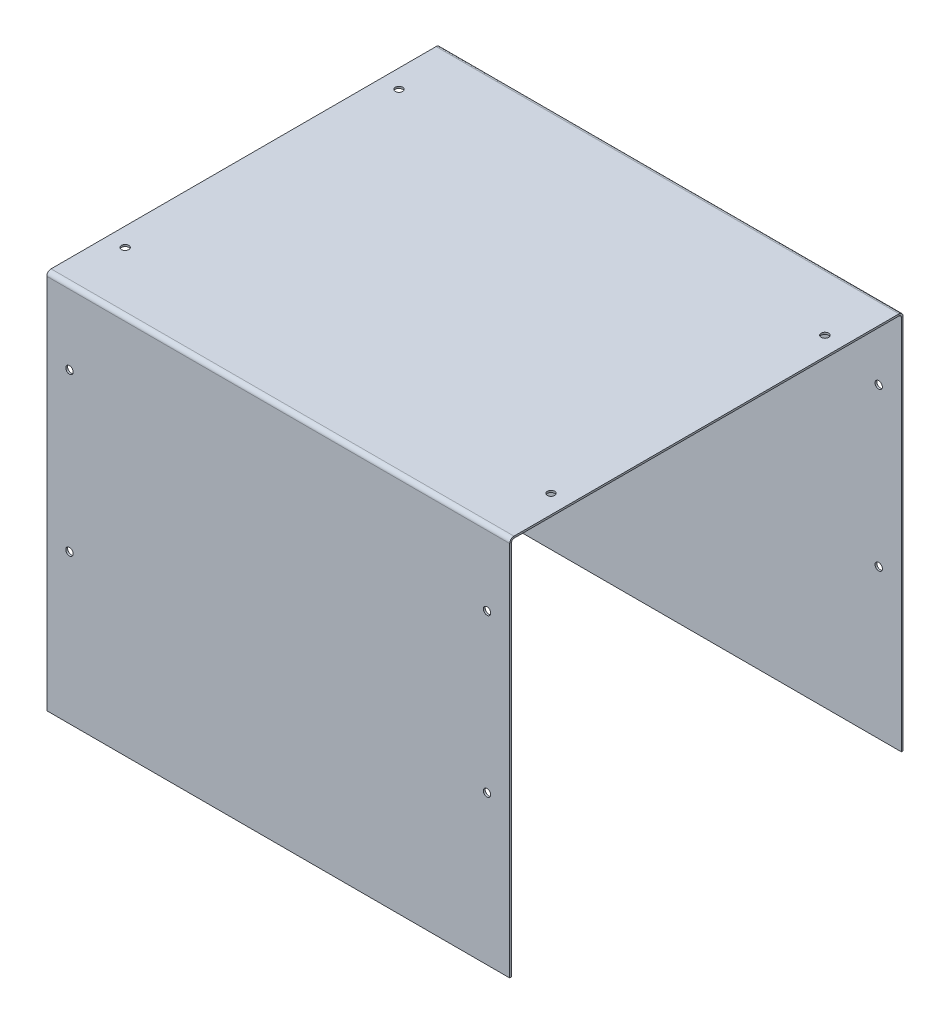
ISO-10303-21;
HEADER;
FILE_DESCRIPTION(('STEP AP214'),'2;1');
FILE_NAME('part.step','',(''),(''),'','','');
FILE_SCHEMA(('AUTOMOTIVE_DESIGN { 1 0 10303 214 1 1 1 1 }'));
ENDSEC;
DATA;
#1=APPLICATION_CONTEXT('core data for automotive mechanical design processes');
#2=APPLICATION_PROTOCOL_DEFINITION('international standard','automotive_design',2000,#1);
#3=PRODUCT_CONTEXT('',#1,'mechanical');
#4=PRODUCT('Part','Part','',(#3));
#5=PRODUCT_RELATED_PRODUCT_CATEGORY('part','',(#4));
#6=PRODUCT_DEFINITION_FORMATION('','',#4);
#7=PRODUCT_DEFINITION_CONTEXT('part definition',#1,'design');
#8=PRODUCT_DEFINITION('design','',#6,#7);
#9=PRODUCT_DEFINITION_SHAPE('','',#8);
#10=(LENGTH_UNIT() NAMED_UNIT(*) SI_UNIT(.MILLI.,.METRE.));
#11=(NAMED_UNIT(*) PLANE_ANGLE_UNIT() SI_UNIT($,.RADIAN.));
#12=(NAMED_UNIT(*) SI_UNIT($,.STERADIAN.) SOLID_ANGLE_UNIT());
#13=UNCERTAINTY_MEASURE_WITH_UNIT(LENGTH_MEASURE(1.E-05),#10,'distance_accuracy_value','');
#14=(GEOMETRIC_REPRESENTATION_CONTEXT(3) GLOBAL_UNCERTAINTY_ASSIGNED_CONTEXT((#13)) GLOBAL_UNIT_ASSIGNED_CONTEXT((#10,
#11,#12)) REPRESENTATION_CONTEXT('',''));
#15=CARTESIAN_POINT('',(0.,0.,0.));
#16=DIRECTION('',(0.,0.,1.));
#17=DIRECTION('',(1.,0.,0.));
#18=AXIS2_PLACEMENT_3D('',#15,#16,#17);
#19=CARTESIAN_POINT('',(250.,-411.,212.500000000001));
#20=DIRECTION('',(0.,1.,0.));
#21=DIRECTION('',(1.,0.,0.));
#22=AXIS2_PLACEMENT_3D('',#19,#20,#21);
#23=PLANE('',#22);
#24=DIRECTION('',(0.,0.,1.));
#25=VECTOR('',#24,1.);
#26=CARTESIAN_POINT('',(-250.,-411.,212.500000000001));
#27=LINE('',#26,#25);
#28=CARTESIAN_POINT('',(-250.,-411.,210.500000000001));
#29=VERTEX_POINT('',#28);
#30=CARTESIAN_POINT('',(-250.,-411.,212.500000000001));
#31=VERTEX_POINT('',#30);
#32=EDGE_CURVE('E11',#29,#31,#27,.T.);
#33=ORIENTED_EDGE('',*,*,#32,.F.);
#34=DIRECTION('',(1.,0.,0.));
#35=VECTOR('',#34,1.);
#36=CARTESIAN_POINT('',(0.,-411.,210.500000000001));
#37=LINE('',#36,#35);
#38=CARTESIAN_POINT('',(250.,-411.,210.500000000001));
#39=VERTEX_POINT('',#38);
#40=EDGE_CURVE('E137',#29,#39,#37,.T.);
#41=ORIENTED_EDGE('',*,*,#40,.T.);
#42=DIRECTION('',(0.,0.,1.));
#43=VECTOR('',#42,1.);
#44=CARTESIAN_POINT('',(250.,-411.,212.500000000001));
#45=LINE('',#44,#43);
#46=CARTESIAN_POINT('',(250.,-411.,212.500000000001));
#47=VERTEX_POINT('',#46);
#48=EDGE_CURVE('E51',#39,#47,#45,.T.);
#49=ORIENTED_EDGE('',*,*,#48,.T.);
#50=DIRECTION('',(1.,0.,0.));
#51=VECTOR('',#50,1.);
#52=CARTESIAN_POINT('',(250.,-411.,212.500000000001));
#53=LINE('',#52,#51);
#54=EDGE_CURVE('E258',#31,#47,#53,.T.);
#55=ORIENTED_EDGE('',*,*,#54,.F.);
#56=EDGE_LOOP('',(#33,#41,#49,#55));
#57=FACE_BOUND('',#56,.T.);
#58=ADVANCED_FACE('F41',(#57),#23,.F.);
#59=CARTESIAN_POINT('',(250.,-1.99999999999999,212.5));
#60=DIRECTION('',(-1.,0.,0.));
#61=DIRECTION('',(0.,1.,0.));
#62=AXIS2_PLACEMENT_3D('',#59,#60,#61);
#63=PLANE('',#62);
#64=ORIENTED_EDGE('',*,*,#48,.F.);
#65=DIRECTION('',(0.,1.,0.));
#66=VECTOR('',#65,1.);
#67=CARTESIAN_POINT('',(250.,7.28593997662503E-13,210.5));
#68=LINE('',#67,#66);
#69=CARTESIAN_POINT('',(250.,-4.59999999999997,210.5));
#70=VERTEX_POINT('',#69);
#71=EDGE_CURVE('E144',#39,#70,#68,.T.);
#72=ORIENTED_EDGE('',*,*,#71,.T.);
#73=DIRECTION('',(0.,0.,1.));
#74=VECTOR('',#73,1.);
#75=CARTESIAN_POINT('',(250.,-4.59999999999996,212.5));
#76=LINE('',#75,#74);
#77=CARTESIAN_POINT('',(250.,-4.59999999999996,212.5));
#78=VERTEX_POINT('',#77);
#79=EDGE_CURVE('E59',#70,#78,#76,.T.);
#80=ORIENTED_EDGE('',*,*,#79,.T.);
#81=DIRECTION('',(0.,1.,0.));
#82=VECTOR('',#81,1.);
#83=CARTESIAN_POINT('',(250.,-1.99999999999999,212.5));
#84=LINE('',#83,#82);
#85=EDGE_CURVE('E261',#47,#78,#84,.T.);
#86=ORIENTED_EDGE('',*,*,#85,.F.);
#87=EDGE_LOOP('',(#64,#72,#80,#86));
#88=FACE_BOUND('',#87,.T.);
#89=ADVANCED_FACE('F265',(#88),#63,.F.);
#90=CARTESIAN_POINT('',(250.,-4.59999999999998,207.9));
#91=DIRECTION('',(1.,0.,0.));
#92=DIRECTION('',(0.,0.,-1.));
#93=AXIS2_PLACEMENT_3D('',#90,#91,#92);
#94=PLANE('',#93);
#95=ORIENTED_EDGE('',*,*,#79,.F.);
#96=CARTESIAN_POINT('',(250.,-4.59999999999998,207.9));
#97=DIRECTION('',(-1.,0.,0.));
#98=DIRECTION('',(0.,0.,1.));
#99=AXIS2_PLACEMENT_3D('',#96,#97,#98);
#100=CIRCLE('',#99,2.59999999999999);
#101=CARTESIAN_POINT('',(250.,-2.,207.9));
#102=VERTEX_POINT('',#101);
#103=EDGE_CURVE('E130',#102,#70,#100,.F.);
#104=ORIENTED_EDGE('',*,*,#103,.F.);
#105=DIRECTION('',(0.,1.,0.));
#106=VECTOR('',#105,1.);
#107=CARTESIAN_POINT('',(250.,0.,207.9));
#108=LINE('',#107,#106);
#109=CARTESIAN_POINT('',(250.,0.,207.9));
#110=VERTEX_POINT('',#109);
#111=EDGE_CURVE('E253',#102,#110,#108,.T.);
#112=ORIENTED_EDGE('',*,*,#111,.T.);
#113=CARTESIAN_POINT('',(250.,-4.59999999999998,207.9));
#114=DIRECTION('',(-1.,0.,0.));
#115=DIRECTION('',(0.,0.,1.));
#116=AXIS2_PLACEMENT_3D('',#113,#114,#115);
#117=CIRCLE('',#116,4.59999999999999);
#118=EDGE_CURVE('E119',#110,#78,#117,.F.);
#119=ORIENTED_EDGE('',*,*,#118,.T.);
#120=EDGE_LOOP('',(#95,#104,#112,#119));
#121=FACE_BOUND('',#120,.T.);
#122=ADVANCED_FACE('F507',(#121),#94,.T.);
#123=CARTESIAN_POINT('',(250.,0.,210.5));
#124=DIRECTION('',(-1.,0.,0.));
#125=DIRECTION('',(0.,0.,-1.));
#126=AXIS2_PLACEMENT_3D('',#123,#124,#125);
#127=PLANE('',#126);
#128=ORIENTED_EDGE('',*,*,#111,.F.);
#129=DIRECTION('',(0.,0.,-1.));
#130=VECTOR('',#129,1.);
#131=CARTESIAN_POINT('',(250.,-2.,0.));
#132=LINE('',#131,#130);
#133=CARTESIAN_POINT('',(250.,-2.00000000000002,-207.9));
#134=VERTEX_POINT('',#133);
#135=EDGE_CURVE('E182',#102,#134,#132,.T.);
#136=ORIENTED_EDGE('',*,*,#135,.T.);
#137=DIRECTION('',(0.,1.,0.));
#138=VECTOR('',#137,1.);
#139=CARTESIAN_POINT('',(250.,0.,-207.9));
#140=LINE('',#139,#138);
#141=CARTESIAN_POINT('',(250.,0.,-207.9));
#142=VERTEX_POINT('',#141);
#143=EDGE_CURVE('E250',#134,#142,#140,.T.);
#144=ORIENTED_EDGE('',*,*,#143,.T.);
#145=DIRECTION('',(0.,0.,-1.));
#146=VECTOR('',#145,1.);
#147=CARTESIAN_POINT('',(250.,0.,210.5));
#148=LINE('',#147,#146);
#149=EDGE_CURVE('E343',#110,#142,#148,.T.);
#150=ORIENTED_EDGE('',*,*,#149,.F.);
#151=EDGE_LOOP('',(#128,#136,#144,#150));
#152=FACE_BOUND('',#151,.T.);
#153=ADVANCED_FACE('F341',(#152),#127,.F.);
#154=CARTESIAN_POINT('',(250.,-4.60000000000001,-207.9));
#155=DIRECTION('',(-1.,0.,0.));
#156=DIRECTION('',(0.,0.,1.));
#157=AXIS2_PLACEMENT_3D('',#154,#155,#156);
#158=PLANE('',#157);
#159=ORIENTED_EDGE('',*,*,#143,.F.);
#160=CARTESIAN_POINT('',(250.,-4.60000000000001,-207.9));
#161=DIRECTION('',(1.,0.,0.));
#162=DIRECTION('',(0.,0.,-1.));
#163=AXIS2_PLACEMENT_3D('',#160,#161,#162);
#164=CIRCLE('',#163,2.59999999999999);
#165=CARTESIAN_POINT('',(250.,-4.59999999999999,-210.5));
#166=VERTEX_POINT('',#165);
#167=EDGE_CURVE('E166',#166,#134,#164,.T.);
#168=ORIENTED_EDGE('',*,*,#167,.F.);
#169=DIRECTION('',(0.,0.,-1.));
#170=VECTOR('',#169,1.);
#171=CARTESIAN_POINT('',(250.,-4.59999999999998,-212.5));
#172=LINE('',#171,#170);
#173=CARTESIAN_POINT('',(250.,-4.59999999999998,-212.5));
#174=VERTEX_POINT('',#173);
#175=EDGE_CURVE('E247',#166,#174,#172,.T.);
#176=ORIENTED_EDGE('',*,*,#175,.T.);
#177=CARTESIAN_POINT('',(250.,-4.60000000000001,-207.9));
#178=DIRECTION('',(1.,0.,0.));
#179=DIRECTION('',(0.,0.,-1.));
#180=AXIS2_PLACEMENT_3D('',#177,#178,#179);
#181=CIRCLE('',#180,4.59999999999999);
#182=EDGE_CURVE('E336',#174,#142,#181,.T.);
#183=ORIENTED_EDGE('',*,*,#182,.T.);
#184=EDGE_LOOP('',(#159,#168,#176,#183));
#185=FACE_BOUND('',#184,.T.);
#186=ADVANCED_FACE('F331',(#185),#158,.F.);
#187=CARTESIAN_POINT('',(250.,-411.,-212.500000000001));
#188=DIRECTION('',(-1.,0.,0.));
#189=DIRECTION('',(0.,-1.,0.));
#190=AXIS2_PLACEMENT_3D('',#187,#188,#189);
#191=PLANE('',#190);
#192=ORIENTED_EDGE('',*,*,#175,.F.);
#193=DIRECTION('',(0.,-1.,0.));
#194=VECTOR('',#193,1.);
#195=CARTESIAN_POINT('',(250.,7.28593997662503E-13,-210.5));
#196=LINE('',#195,#194);
#197=CARTESIAN_POINT('',(250.,-411.,-210.500000000001));
#198=VERTEX_POINT('',#197);
#199=EDGE_CURVE('E175',#166,#198,#196,.T.);
#200=ORIENTED_EDGE('',*,*,#199,.T.);
#201=DIRECTION('',(0.,0.,-1.));
#202=VECTOR('',#201,1.);
#203=CARTESIAN_POINT('',(250.,-411.,-212.500000000001));
#204=LINE('',#203,#202);
#205=CARTESIAN_POINT('',(250.,-411.,-212.500000000001));
#206=VERTEX_POINT('',#205);
#207=EDGE_CURVE('E244',#198,#206,#204,.T.);
#208=ORIENTED_EDGE('',*,*,#207,.T.);
#209=DIRECTION('',(0.,-1.,0.));
#210=VECTOR('',#209,1.);
#211=CARTESIAN_POINT('',(250.,-411.,-212.500000000001));
#212=LINE('',#211,#210);
#213=EDGE_CURVE('E381',#174,#206,#212,.T.);
#214=ORIENTED_EDGE('',*,*,#213,.F.);
#215=EDGE_LOOP('',(#192,#200,#208,#214));
#216=FACE_BOUND('',#215,.T.);
#217=ADVANCED_FACE('F570',(#216),#191,.F.);
#218=CARTESIAN_POINT('',(-250.,-411.,-212.500000000001));
#219=DIRECTION('',(0.,1.,0.));
#220=DIRECTION('',(-1.,0.,0.));
#221=AXIS2_PLACEMENT_3D('',#218,#219,#220);
#222=PLANE('',#221);
#223=ORIENTED_EDGE('',*,*,#207,.F.);
#224=DIRECTION('',(1.,0.,0.));
#225=VECTOR('',#224,1.);
#226=CARTESIAN_POINT('',(0.,-411.,-210.500000000001));
#227=LINE('',#226,#225);
#228=CARTESIAN_POINT('',(-250.,-411.,-210.500000000001));
#229=VERTEX_POINT('',#228);
#230=EDGE_CURVE('E171',#198,#229,#227,.F.);
#231=ORIENTED_EDGE('',*,*,#230,.T.);
#232=DIRECTION('',(0.,0.,-1.));
#233=VECTOR('',#232,1.);
#234=CARTESIAN_POINT('',(-250.,-411.,-212.500000000001));
#235=LINE('',#234,#233);
#236=CARTESIAN_POINT('',(-250.,-411.,-212.500000000001));
#237=VERTEX_POINT('',#236);
#238=EDGE_CURVE('E241',#229,#237,#235,.T.);
#239=ORIENTED_EDGE('',*,*,#238,.T.);
#240=DIRECTION('',(-1.,0.,0.));
#241=VECTOR('',#240,1.);
#242=CARTESIAN_POINT('',(-250.,-411.,-212.500000000001));
#243=LINE('',#242,#241);
#244=EDGE_CURVE('E385',#206,#237,#243,.T.);
#245=ORIENTED_EDGE('',*,*,#244,.F.);
#246=EDGE_LOOP('',(#223,#231,#239,#245));
#247=FACE_BOUND('',#246,.T.);
#248=ADVANCED_FACE('F572',(#247),#222,.F.);
#249=CARTESIAN_POINT('',(-250.,-1.99999999999999,-212.5));
#250=DIRECTION('',(1.,0.,0.));
#251=DIRECTION('',(0.,1.,0.));
#252=AXIS2_PLACEMENT_3D('',#249,#250,#251);
#253=PLANE('',#252);
#254=ORIENTED_EDGE('',*,*,#238,.F.);
#255=DIRECTION('',(0.,-1.,0.));
#256=VECTOR('',#255,1.);
#257=CARTESIAN_POINT('',(-250.,7.28593997662503E-13,-210.5));
#258=LINE('',#257,#256);
#259=CARTESIAN_POINT('',(-250.,-4.6,-210.5));
#260=VERTEX_POINT('',#259);
#261=EDGE_CURVE('E167',#229,#260,#258,.F.);
#262=ORIENTED_EDGE('',*,*,#261,.T.);
#263=DIRECTION('',(0.,0.,-1.));
#264=VECTOR('',#263,1.);
#265=CARTESIAN_POINT('',(-250.,-4.6,-212.5));
#266=LINE('',#265,#264);
#267=CARTESIAN_POINT('',(-250.,-4.6,-212.5));
#268=VERTEX_POINT('',#267);
#269=EDGE_CURVE('E238',#260,#268,#266,.T.);
#270=ORIENTED_EDGE('',*,*,#269,.T.);
#271=DIRECTION('',(0.,1.,0.));
#272=VECTOR('',#271,1.);
#273=CARTESIAN_POINT('',(-250.,-1.99999999999999,-212.5));
#274=LINE('',#273,#272);
#275=EDGE_CURVE('E389',#237,#268,#274,.T.);
#276=ORIENTED_EDGE('',*,*,#275,.F.);
#277=EDGE_LOOP('',(#254,#262,#270,#276));
#278=FACE_BOUND('',#277,.T.);
#279=ADVANCED_FACE('F573',(#278),#253,.F.);
#280=CARTESIAN_POINT('',(-250.,-4.60000000000001,-207.9));
#281=DIRECTION('',(-1.,0.,0.));
#282=DIRECTION('',(0.,0.,1.));
#283=AXIS2_PLACEMENT_3D('',#280,#281,#282);
#284=PLANE('',#283);
#285=ORIENTED_EDGE('',*,*,#269,.F.);
#286=CARTESIAN_POINT('',(-250.,-4.60000000000001,-207.9));
#287=DIRECTION('',(1.,0.,0.));
#288=DIRECTION('',(0.,0.,-1.));
#289=AXIS2_PLACEMENT_3D('',#286,#287,#288);
#290=CIRCLE('',#289,2.59999999999999);
#291=CARTESIAN_POINT('',(-250.,-2.,-207.9));
#292=VERTEX_POINT('',#291);
#293=EDGE_CURVE('E161',#292,#260,#290,.F.);
#294=ORIENTED_EDGE('',*,*,#293,.F.);
#295=DIRECTION('',(0.,1.,0.));
#296=VECTOR('',#295,1.);
#297=CARTESIAN_POINT('',(-250.,0.,-207.9));
#298=LINE('',#297,#296);
#299=CARTESIAN_POINT('',(-250.,0.,-207.9));
#300=VERTEX_POINT('',#299);
#301=EDGE_CURVE('E235',#292,#300,#298,.T.);
#302=ORIENTED_EDGE('',*,*,#301,.T.);
#303=CARTESIAN_POINT('',(-250.,-4.60000000000001,-207.9));
#304=DIRECTION('',(1.,0.,0.));
#305=DIRECTION('',(0.,0.,-1.));
#306=AXIS2_PLACEMENT_3D('',#303,#304,#305);
#307=CIRCLE('',#306,4.59999999999999);
#308=EDGE_CURVE('E297',#300,#268,#307,.F.);
#309=ORIENTED_EDGE('',*,*,#308,.T.);
#310=EDGE_LOOP('',(#285,#294,#302,#309));
#311=FACE_BOUND('',#310,.T.);
#312=ADVANCED_FACE('F292',(#311),#284,.T.);
#313=CARTESIAN_POINT('',(-250.,0.,210.5));
#314=DIRECTION('',(1.,0.,0.));
#315=DIRECTION('',(0.,0.,1.));
#316=AXIS2_PLACEMENT_3D('',#313,#314,#315);
#317=PLANE('',#316);
#318=ORIENTED_EDGE('',*,*,#301,.F.);
#319=DIRECTION('',(0.,0.,-1.));
#320=VECTOR('',#319,1.);
#321=CARTESIAN_POINT('',(-250.,-2.,0.));
#322=LINE('',#321,#320);
#323=CARTESIAN_POINT('',(-250.,-2.,207.9));
#324=VERTEX_POINT('',#323);
#325=EDGE_CURVE('E156',#292,#324,#322,.F.);
#326=ORIENTED_EDGE('',*,*,#325,.T.);
#327=DIRECTION('',(0.,1.,0.));
#328=VECTOR('',#327,1.);
#329=CARTESIAN_POINT('',(-250.,0.,207.9));
#330=LINE('',#329,#328);
#331=CARTESIAN_POINT('',(-250.,0.,207.9));
#332=VERTEX_POINT('',#331);
#333=EDGE_CURVE('E118',#324,#332,#330,.T.);
#334=ORIENTED_EDGE('',*,*,#333,.T.);
#335=DIRECTION('',(0.,0.,1.));
#336=VECTOR('',#335,1.);
#337=CARTESIAN_POINT('',(-250.,0.,210.5));
#338=LINE('',#337,#336);
#339=EDGE_CURVE('E363',#300,#332,#338,.T.);
#340=ORIENTED_EDGE('',*,*,#339,.F.);
#341=EDGE_LOOP('',(#318,#326,#334,#340));
#342=FACE_BOUND('',#341,.T.);
#343=ADVANCED_FACE('F447',(#342),#317,.F.);
#344=CARTESIAN_POINT('',(-250.,-4.59999999999998,207.9));
#345=DIRECTION('',(1.,0.,0.));
#346=DIRECTION('',(0.,0.,-1.));
#347=AXIS2_PLACEMENT_3D('',#344,#345,#346);
#348=PLANE('',#347);
#349=ORIENTED_EDGE('',*,*,#333,.F.);
#350=CARTESIAN_POINT('',(-250.,-4.59999999999998,207.9));
#351=DIRECTION('',(-1.,0.,0.));
#352=DIRECTION('',(0.,0.,1.));
#353=AXIS2_PLACEMENT_3D('',#350,#351,#352);
#354=CIRCLE('',#353,2.59999999999999);
#355=CARTESIAN_POINT('',(-250.,-4.59999999999997,210.5));
#356=VERTEX_POINT('',#355);
#357=EDGE_CURVE('E127',#356,#324,#354,.T.);
#358=ORIENTED_EDGE('',*,*,#357,.F.);
#359=DIRECTION('',(0.,0.,1.));
#360=VECTOR('',#359,1.);
#361=CARTESIAN_POINT('',(-250.,-4.59999999999997,212.5));
#362=LINE('',#361,#360);
#363=CARTESIAN_POINT('',(-250.,-4.59999999999997,212.5));
#364=VERTEX_POINT('',#363);
#365=EDGE_CURVE('E45',#356,#364,#362,.T.);
#366=ORIENTED_EDGE('',*,*,#365,.T.);
#367=CARTESIAN_POINT('',(-250.,-4.59999999999998,207.9));
#368=DIRECTION('',(-1.,0.,0.));
#369=DIRECTION('',(0.,0.,1.));
#370=AXIS2_PLACEMENT_3D('',#367,#368,#369);
#371=CIRCLE('',#370,4.59999999999999);
#372=EDGE_CURVE('E267',#364,#332,#371,.T.);
#373=ORIENTED_EDGE('',*,*,#372,.T.);
#374=EDGE_LOOP('',(#349,#358,#366,#373));
#375=FACE_BOUND('',#374,.T.);
#376=ADVANCED_FACE('F140',(#375),#348,.F.);
#377=CARTESIAN_POINT('',(-230.,0.,147.9));
#378=DIRECTION('',(0.,-1.,0.));
#379=DIRECTION('',(0.,0.,-1.));
#380=AXIS2_PLACEMENT_3D('',#377,#378,#379);
#381=CYLINDRICAL_SURFACE('',#380,3.99999999999999);
#382=CARTESIAN_POINT('',(-230.,0.,147.9));
#383=DIRECTION('',(0.,1.,0.));
#384=DIRECTION('',(0.,0.,-1.));
#385=AXIS2_PLACEMENT_3D('',#382,#383,#384);
#386=CIRCLE('',#385,3.99999999999999);
#387=CARTESIAN_POINT('',(-230.,0.,143.9));
#388=VERTEX_POINT('',#387);
#389=EDGE_CURVE('E149',#388,#388,#386,.T.);
#390=ORIENTED_EDGE('',*,*,#389,.T.);
#391=EDGE_LOOP('',(#390));
#392=FACE_BOUND('',#391,.T.);
#393=CARTESIAN_POINT('',(-230.,-2.,147.9));
#394=DIRECTION('',(0.,1.,0.));
#395=DIRECTION('',(0.,0.,1.));
#396=AXIS2_PLACEMENT_3D('',#393,#394,#395);
#397=CIRCLE('',#396,3.99999999999999);
#398=CARTESIAN_POINT('',(-230.,-2.,151.9));
#399=VERTEX_POINT('',#398);
#400=EDGE_CURVE('E203',#399,#399,#397,.T.);
#401=ORIENTED_EDGE('',*,*,#400,.F.);
#402=EDGE_LOOP('',(#401));
#403=FACE_BOUND('',#402,.T.);
#404=ADVANCED_FACE('F470',(#392,#403),#381,.F.);
#405=CARTESIAN_POINT('',(230.,0.,147.9));
#406=DIRECTION('',(0.,-1.,0.));
#407=DIRECTION('',(0.,0.,-1.));
#408=AXIS2_PLACEMENT_3D('',#405,#406,#407);
#409=CYLINDRICAL_SURFACE('',#408,3.99999999999999);
#410=CARTESIAN_POINT('',(230.,0.,147.9));
#411=DIRECTION('',(0.,-1.,0.));
#412=DIRECTION('',(0.,0.,-1.));
#413=AXIS2_PLACEMENT_3D('',#410,#411,#412);
#414=CIRCLE('',#413,3.99999999999999);
#415=CARTESIAN_POINT('',(230.,0.,143.9));
#416=VERTEX_POINT('',#415);
#417=EDGE_CURVE('E461',#416,#416,#414,.T.);
#418=ORIENTED_EDGE('',*,*,#417,.F.);
#419=EDGE_LOOP('',(#418));
#420=FACE_BOUND('',#419,.T.);
#421=CARTESIAN_POINT('',(230.,-2.,147.9));
#422=DIRECTION('',(0.,-1.,0.));
#423=DIRECTION('',(0.,0.,-1.));
#424=AXIS2_PLACEMENT_3D('',#421,#422,#423);
#425=CIRCLE('',#424,3.99999999999999);
#426=CARTESIAN_POINT('',(230.,-2.,143.9));
#427=VERTEX_POINT('',#426);
#428=EDGE_CURVE('E207',#427,#427,#425,.T.);
#429=ORIENTED_EDGE('',*,*,#428,.T.);
#430=EDGE_LOOP('',(#429));
#431=FACE_BOUND('',#430,.T.);
#432=ADVANCED_FACE('F531',(#420,#431),#409,.F.);
#433=CARTESIAN_POINT('',(-230.,0.,-147.9));
#434=DIRECTION('',(0.,-1.,0.));
#435=DIRECTION('',(0.,0.,-1.));
#436=AXIS2_PLACEMENT_3D('',#433,#434,#435);
#437=CYLINDRICAL_SURFACE('',#436,3.99999999999999);
#438=CARTESIAN_POINT('',(-230.,0.,-147.9));
#439=DIRECTION('',(0.,-1.,0.));
#440=DIRECTION('',(0.,0.,1.));
#441=AXIS2_PLACEMENT_3D('',#438,#439,#440);
#442=CIRCLE('',#441,3.99999999999999);
#443=CARTESIAN_POINT('',(-230.,0.,-143.9));
#444=VERTEX_POINT('',#443);
#445=EDGE_CURVE('E457',#444,#444,#442,.T.);
#446=ORIENTED_EDGE('',*,*,#445,.F.);
#447=EDGE_LOOP('',(#446));
#448=FACE_BOUND('',#447,.T.);
#449=CARTESIAN_POINT('',(-230.,-2.,-147.9));
#450=DIRECTION('',(0.,-1.,0.));
#451=DIRECTION('',(0.,0.,-1.));
#452=AXIS2_PLACEMENT_3D('',#449,#450,#451);
#453=CIRCLE('',#452,3.99999999999999);
#454=CARTESIAN_POINT('',(-230.,-2.,-151.9));
#455=VERTEX_POINT('',#454);
#456=EDGE_CURVE('E211',#455,#455,#453,.T.);
#457=ORIENTED_EDGE('',*,*,#456,.T.);
#458=EDGE_LOOP('',(#457));
#459=FACE_BOUND('',#458,.T.);
#460=ADVANCED_FACE('F487',(#448,#459),#437,.F.);
#461=CARTESIAN_POINT('',(230.,0.,-147.9));
#462=DIRECTION('',(0.,-1.,0.));
#463=DIRECTION('',(0.,0.,-1.));
#464=AXIS2_PLACEMENT_3D('',#461,#462,#463);
#465=CYLINDRICAL_SURFACE('',#464,3.99999999999999);
#466=CARTESIAN_POINT('',(230.,0.,-147.9));
#467=DIRECTION('',(0.,1.,0.));
#468=DIRECTION('',(0.,0.,1.));
#469=AXIS2_PLACEMENT_3D('',#466,#467,#468);
#470=CIRCLE('',#469,3.99999999999999);
#471=CARTESIAN_POINT('',(230.,0.,-143.9));
#472=VERTEX_POINT('',#471);
#473=EDGE_CURVE('E451',#472,#472,#470,.T.);
#474=ORIENTED_EDGE('',*,*,#473,.T.);
#475=EDGE_LOOP('',(#474));
#476=FACE_BOUND('',#475,.T.);
#477=CARTESIAN_POINT('',(230.,-2.,-147.9));
#478=DIRECTION('',(0.,1.,0.));
#479=DIRECTION('',(0.,0.,1.));
#480=AXIS2_PLACEMENT_3D('',#477,#478,#479);
#481=CIRCLE('',#480,3.99999999999999);
#482=CARTESIAN_POINT('',(230.,-2.,-143.9));
#483=VERTEX_POINT('',#482);
#484=EDGE_CURVE('E215',#483,#483,#481,.T.);
#485=ORIENTED_EDGE('',*,*,#484,.F.);
#486=EDGE_LOOP('',(#485));
#487=FACE_BOUND('',#486,.T.);
#488=ADVANCED_FACE('F483',(#476,#487),#465,.F.);
#489=CARTESIAN_POINT('',(-225.5,-80.,-212.500000000001));
#490=DIRECTION('',(0.,0.,1.));
#491=DIRECTION('',(0.,-1.,0.));
#492=AXIS2_PLACEMENT_3D('',#489,#490,#491);
#493=CYLINDRICAL_SURFACE('',#492,3.99999999999999);
#494=CARTESIAN_POINT('',(-225.5,-80.,-212.500000000001));
#495=DIRECTION('',(0.,0.,-1.));
#496=DIRECTION('',(-1.,0.,0.));
#497=AXIS2_PLACEMENT_3D('',#494,#495,#496);
#498=CIRCLE('',#497,3.99999999999999);
#499=CARTESIAN_POINT('',(-229.5,-80.,-212.500000000001));
#500=VERTEX_POINT('',#499);
#501=EDGE_CURVE('E355',#500,#500,#498,.T.);
#502=ORIENTED_EDGE('',*,*,#501,.T.);
#503=EDGE_LOOP('',(#502));
#504=FACE_BOUND('',#503,.T.);
#505=CARTESIAN_POINT('',(-225.5,-80.,-210.500000000001));
#506=DIRECTION('',(0.,0.,-1.));
#507=DIRECTION('',(-1.,0.,0.));
#508=AXIS2_PLACEMENT_3D('',#505,#506,#507);
#509=CIRCLE('',#508,3.99999999999999);
#510=CARTESIAN_POINT('',(-229.5,-80.,-210.500000000001));
#511=VERTEX_POINT('',#510);
#512=EDGE_CURVE('E185',#511,#511,#509,.T.);
#513=ORIENTED_EDGE('',*,*,#512,.F.);
#514=EDGE_LOOP('',(#513));
#515=FACE_BOUND('',#514,.T.);
#516=ADVANCED_FACE('F486',(#504,#515),#493,.F.);
#517=CARTESIAN_POINT('',(-225.5,-250.,-212.500000000001));
#518=DIRECTION('',(0.,0.,1.));
#519=DIRECTION('',(0.,-1.,0.));
#520=AXIS2_PLACEMENT_3D('',#517,#518,#519);
#521=CYLINDRICAL_SURFACE('',#520,3.99999999999999);
#522=CARTESIAN_POINT('',(-225.5,-250.,-212.500000000001));
#523=DIRECTION('',(0.,0.,-1.));
#524=DIRECTION('',(-1.,0.,0.));
#525=AXIS2_PLACEMENT_3D('',#522,#523,#524);
#526=CIRCLE('',#525,3.99999999999999);
#527=CARTESIAN_POINT('',(-229.5,-250.,-212.500000000001));
#528=VERTEX_POINT('',#527);
#529=EDGE_CURVE('E361',#528,#528,#526,.T.);
#530=ORIENTED_EDGE('',*,*,#529,.T.);
#531=EDGE_LOOP('',(#530));
#532=FACE_BOUND('',#531,.T.);
#533=CARTESIAN_POINT('',(-225.5,-250.,-210.500000000001));
#534=DIRECTION('',(0.,0.,-1.));
#535=DIRECTION('',(-1.,0.,0.));
#536=AXIS2_PLACEMENT_3D('',#533,#534,#535);
#537=CIRCLE('',#536,3.99999999999999);
#538=CARTESIAN_POINT('',(-229.5,-250.,-210.500000000001));
#539=VERTEX_POINT('',#538);
#540=EDGE_CURVE('E222',#539,#539,#537,.T.);
#541=ORIENTED_EDGE('',*,*,#540,.F.);
#542=EDGE_LOOP('',(#541));
#543=FACE_BOUND('',#542,.T.);
#544=ADVANCED_FACE('F540',(#532,#543),#521,.F.);
#545=CARTESIAN_POINT('',(225.5,-80.,-212.500000000001));
#546=DIRECTION('',(0.,0.,1.));
#547=DIRECTION('',(0.,-1.,0.));
#548=AXIS2_PLACEMENT_3D('',#545,#546,#547);
#549=CYLINDRICAL_SURFACE('',#548,3.99999999999999);
#550=CARTESIAN_POINT('',(225.5,-80.,-212.500000000001));
#551=DIRECTION('',(0.,0.,1.));
#552=DIRECTION('',(1.,0.,0.));
#553=AXIS2_PLACEMENT_3D('',#550,#551,#552);
#554=CIRCLE('',#553,3.99999999999999);
#555=CARTESIAN_POINT('',(229.5,-80.,-212.500000000001));
#556=VERTEX_POINT('',#555);
#557=EDGE_CURVE('E370',#556,#556,#554,.T.);
#558=ORIENTED_EDGE('',*,*,#557,.F.);
#559=EDGE_LOOP('',(#558));
#560=FACE_BOUND('',#559,.T.);
#561=CARTESIAN_POINT('',(225.5,-80.,-210.500000000001));
#562=DIRECTION('',(0.,0.,1.));
#563=DIRECTION('',(1.,0.,0.));
#564=AXIS2_PLACEMENT_3D('',#561,#562,#563);
#565=CIRCLE('',#564,3.99999999999999);
#566=CARTESIAN_POINT('',(229.5,-80.,-210.500000000001));
#567=VERTEX_POINT('',#566);
#568=EDGE_CURVE('E226',#567,#567,#565,.T.);
#569=ORIENTED_EDGE('',*,*,#568,.T.);
#570=EDGE_LOOP('',(#569));
#571=FACE_BOUND('',#570,.T.);
#572=ADVANCED_FACE('F543',(#560,#571),#549,.F.);
#573=CARTESIAN_POINT('',(225.5,-250.,-212.500000000001));
#574=DIRECTION('',(0.,0.,1.));
#575=DIRECTION('',(0.,-1.,0.));
#576=AXIS2_PLACEMENT_3D('',#573,#574,#575);
#577=CYLINDRICAL_SURFACE('',#576,3.99999999999999);
#578=CARTESIAN_POINT('',(225.5,-250.,-212.500000000001));
#579=DIRECTION('',(0.,0.,1.));
#580=DIRECTION('',(1.,0.,0.));
#581=AXIS2_PLACEMENT_3D('',#578,#579,#580);
#582=CIRCLE('',#581,3.99999999999999);
#583=CARTESIAN_POINT('',(229.5,-250.,-212.500000000001));
#584=VERTEX_POINT('',#583);
#585=EDGE_CURVE('E374',#584,#584,#582,.T.);
#586=ORIENTED_EDGE('',*,*,#585,.F.);
#587=EDGE_LOOP('',(#586));
#588=FACE_BOUND('',#587,.T.);
#589=CARTESIAN_POINT('',(225.5,-250.,-210.500000000001));
#590=DIRECTION('',(0.,0.,1.));
#591=DIRECTION('',(1.,0.,0.));
#592=AXIS2_PLACEMENT_3D('',#589,#590,#591);
#593=CIRCLE('',#592,3.99999999999999);
#594=CARTESIAN_POINT('',(229.5,-250.,-210.500000000001));
#595=VERTEX_POINT('',#594);
#596=EDGE_CURVE('E230',#595,#595,#593,.T.);
#597=ORIENTED_EDGE('',*,*,#596,.T.);
#598=EDGE_LOOP('',(#597));
#599=FACE_BOUND('',#598,.T.);
#600=ADVANCED_FACE('F43',(#588,#599),#577,.F.);
#601=CARTESIAN_POINT('',(-225.5,-80.,212.500000000001));
#602=DIRECTION('',(0.,0.,-1.));
#603=DIRECTION('',(0.,1.,0.));
#604=AXIS2_PLACEMENT_3D('',#601,#602,#603);
#605=CYLINDRICAL_SURFACE('',#604,3.99999999999999);
#606=CARTESIAN_POINT('',(-225.5,-80.,212.500000000001));
#607=DIRECTION('',(0.,0.,-1.));
#608=DIRECTION('',(-1.,0.,0.));
#609=AXIS2_PLACEMENT_3D('',#606,#607,#608);
#610=CIRCLE('',#609,3.99999999999999);
#611=CARTESIAN_POINT('',(-229.5,-80.,212.500000000001));
#612=VERTEX_POINT('',#611);
#613=EDGE_CURVE('E396',#612,#612,#610,.T.);
#614=ORIENTED_EDGE('',*,*,#613,.F.);
#615=EDGE_LOOP('',(#614));
#616=FACE_BOUND('',#615,.T.);
#617=CARTESIAN_POINT('',(-225.5,-80.,210.500000000001));
#618=DIRECTION('',(0.,0.,-1.));
#619=DIRECTION('',(-1.,0.,0.));
#620=AXIS2_PLACEMENT_3D('',#617,#618,#619);
#621=CIRCLE('',#620,3.99999999999999);
#622=CARTESIAN_POINT('',(-229.5,-80.,210.500000000001));
#623=VERTEX_POINT('',#622);
#624=EDGE_CURVE('E165',#623,#623,#621,.T.);
#625=ORIENTED_EDGE('',*,*,#624,.T.);
#626=EDGE_LOOP('',(#625));
#627=FACE_BOUND('',#626,.T.);
#628=ADVANCED_FACE('F514',(#616,#627),#605,.F.);
#629=CARTESIAN_POINT('',(-225.5,-250.,212.500000000001));
#630=DIRECTION('',(0.,0.,-1.));
#631=DIRECTION('',(0.,1.,0.));
#632=AXIS2_PLACEMENT_3D('',#629,#630,#631);
#633=CYLINDRICAL_SURFACE('',#632,3.99999999999999);
#634=CARTESIAN_POINT('',(-225.5,-250.,212.500000000001));
#635=DIRECTION('',(0.,0.,-1.));
#636=DIRECTION('',(-1.,0.,0.));
#637=AXIS2_PLACEMENT_3D('',#634,#635,#636);
#638=CIRCLE('',#637,3.99999999999999);
#639=CARTESIAN_POINT('',(-229.5,-250.,212.500000000001));
#640=VERTEX_POINT('',#639);
#641=EDGE_CURVE('E400',#640,#640,#638,.T.);
#642=ORIENTED_EDGE('',*,*,#641,.F.);
#643=EDGE_LOOP('',(#642));
#644=FACE_BOUND('',#643,.T.);
#645=CARTESIAN_POINT('',(-225.5,-250.,210.500000000001));
#646=DIRECTION('',(0.,0.,-1.));
#647=DIRECTION('',(-1.,0.,0.));
#648=AXIS2_PLACEMENT_3D('',#645,#646,#647);
#649=CIRCLE('',#648,3.99999999999999);
#650=CARTESIAN_POINT('',(-229.5,-250.,210.500000000001));
#651=VERTEX_POINT('',#650);
#652=EDGE_CURVE('E192',#651,#651,#649,.T.);
#653=ORIENTED_EDGE('',*,*,#652,.T.);
#654=EDGE_LOOP('',(#653));
#655=FACE_BOUND('',#654,.T.);
#656=ADVANCED_FACE('F517',(#644,#655),#633,.F.);
#657=CARTESIAN_POINT('',(225.5,-80.,212.500000000001));
#658=DIRECTION('',(0.,0.,-1.));
#659=DIRECTION('',(0.,1.,0.));
#660=AXIS2_PLACEMENT_3D('',#657,#658,#659);
#661=CYLINDRICAL_SURFACE('',#660,3.99999999999999);
#662=CARTESIAN_POINT('',(225.5,-80.,212.500000000001));
#663=DIRECTION('',(0.,0.,1.));
#664=DIRECTION('',(1.,0.,0.));
#665=AXIS2_PLACEMENT_3D('',#662,#663,#664);
#666=CIRCLE('',#665,3.99999999999999);
#667=CARTESIAN_POINT('',(229.5,-80.,212.500000000001));
#668=VERTEX_POINT('',#667);
#669=EDGE_CURVE('E404',#668,#668,#666,.T.);
#670=ORIENTED_EDGE('',*,*,#669,.T.);
#671=EDGE_LOOP('',(#670));
#672=FACE_BOUND('',#671,.T.);
#673=CARTESIAN_POINT('',(225.5,-80.,210.500000000001));
#674=DIRECTION('',(0.,0.,1.));
#675=DIRECTION('',(1.,0.,0.));
#676=AXIS2_PLACEMENT_3D('',#673,#674,#675);
#677=CIRCLE('',#676,3.99999999999999);
#678=CARTESIAN_POINT('',(229.5,-80.,210.500000000001));
#679=VERTEX_POINT('',#678);
#680=EDGE_CURVE('E196',#679,#679,#677,.T.);
#681=ORIENTED_EDGE('',*,*,#680,.F.);
#682=EDGE_LOOP('',(#681));
#683=FACE_BOUND('',#682,.T.);
#684=ADVANCED_FACE('F521',(#672,#683),#661,.F.);
#685=CARTESIAN_POINT('',(225.5,-250.,212.500000000001));
#686=DIRECTION('',(0.,0.,-1.));
#687=DIRECTION('',(0.,1.,0.));
#688=AXIS2_PLACEMENT_3D('',#685,#686,#687);
#689=CYLINDRICAL_SURFACE('',#688,3.99999999999999);
#690=CARTESIAN_POINT('',(225.5,-250.,212.500000000001));
#691=DIRECTION('',(0.,0.,1.));
#692=DIRECTION('',(1.,0.,0.));
#693=AXIS2_PLACEMENT_3D('',#690,#691,#692);
#694=CIRCLE('',#693,3.99999999999999);
#695=CARTESIAN_POINT('',(229.5,-250.,212.500000000001));
#696=VERTEX_POINT('',#695);
#697=EDGE_CURVE('E408',#696,#696,#694,.T.);
#698=ORIENTED_EDGE('',*,*,#697,.T.);
#699=EDGE_LOOP('',(#698));
#700=FACE_BOUND('',#699,.T.);
#701=CARTESIAN_POINT('',(225.5,-250.,210.500000000001));
#702=DIRECTION('',(0.,0.,1.));
#703=DIRECTION('',(1.,0.,0.));
#704=AXIS2_PLACEMENT_3D('',#701,#702,#703);
#705=CIRCLE('',#704,3.99999999999999);
#706=CARTESIAN_POINT('',(229.5,-250.,210.500000000001));
#707=VERTEX_POINT('',#706);
#708=EDGE_CURVE('E134',#707,#707,#705,.T.);
#709=ORIENTED_EDGE('',*,*,#708,.F.);
#710=EDGE_LOOP('',(#709));
#711=FACE_BOUND('',#710,.T.);
#712=ADVANCED_FACE('F513',(#700,#711),#689,.F.);
#713=CARTESIAN_POINT('',(-250.,-411.,212.500000000001));
#714=DIRECTION('',(1.,0.,0.));
#715=DIRECTION('',(0.,-1.,0.));
#716=AXIS2_PLACEMENT_3D('',#713,#714,#715);
#717=PLANE('',#716);
#718=DIRECTION('',(0.,1.,0.));
#719=VECTOR('',#718,1.);
#720=CARTESIAN_POINT('',(-250.,7.28593997662503E-13,210.5));
#721=LINE('',#720,#719);
#722=EDGE_CURVE('E109',#356,#29,#721,.F.);
#723=ORIENTED_EDGE('',*,*,#722,.T.);
#724=ORIENTED_EDGE('',*,*,#32,.T.);
#725=DIRECTION('',(0.,-1.,0.));
#726=VECTOR('',#725,1.);
#727=CARTESIAN_POINT('',(-250.,-411.,212.500000000001));
#728=LINE('',#727,#726);
#729=EDGE_CURVE('E112',#364,#31,#728,.T.);
#730=ORIENTED_EDGE('',*,*,#729,.F.);
#731=ORIENTED_EDGE('',*,*,#365,.F.);
#732=EDGE_LOOP('',(#723,#724,#730,#731));
#733=FACE_BOUND('',#732,.T.);
#734=ADVANCED_FACE('F107',(#733),#717,.F.);
#735=CARTESIAN_POINT('',(-250.,-4.59999999999998,207.9));
#736=DIRECTION('',(-1.,0.,0.));
#737=DIRECTION('',(0.,0.,1.));
#738=AXIS2_PLACEMENT_3D('',#735,#736,#737);
#739=CYLINDRICAL_SURFACE('',#738,4.59999999999999);
#740=DIRECTION('',(-1.,0.,0.));
#741=VECTOR('',#740,1.);
#742=CARTESIAN_POINT('',(-250.,0.,207.9));
#743=LINE('',#742,#741);
#744=EDGE_CURVE('E353',#332,#110,#743,.F.);
#745=ORIENTED_EDGE('',*,*,#744,.F.);
#746=ORIENTED_EDGE('',*,*,#372,.F.);
#747=DIRECTION('',(1.,0.,0.));
#748=VECTOR('',#747,1.);
#749=CARTESIAN_POINT('',(0.,-4.59999999999998,212.5));
#750=LINE('',#749,#748);
#751=EDGE_CURVE('E412',#364,#78,#750,.T.);
#752=ORIENTED_EDGE('',*,*,#751,.T.);
#753=ORIENTED_EDGE('',*,*,#118,.F.);
#754=EDGE_LOOP('',(#745,#746,#752,#753));
#755=FACE_BOUND('',#754,.T.);
#756=ADVANCED_FACE('F434',(#755),#739,.T.);
#757=CARTESIAN_POINT('',(0.,7.35515926055643E-13,212.5));
#758=DIRECTION('',(0.,0.,-1.));
#759=DIRECTION('',(0.,1.,0.));
#760=AXIS2_PLACEMENT_3D('',#757,#758,#759);
#761=PLANE('',#760);
#762=ORIENTED_EDGE('',*,*,#613,.T.);
#763=EDGE_LOOP('',(#762));
#764=FACE_BOUND('',#763,.T.);
#765=ORIENTED_EDGE('',*,*,#641,.T.);
#766=EDGE_LOOP('',(#765));
#767=FACE_BOUND('',#766,.T.);
#768=ORIENTED_EDGE('',*,*,#669,.F.);
#769=EDGE_LOOP('',(#768));
#770=FACE_BOUND('',#769,.T.);
#771=ORIENTED_EDGE('',*,*,#697,.F.);
#772=EDGE_LOOP('',(#771));
#773=FACE_BOUND('',#772,.T.);
#774=ORIENTED_EDGE('',*,*,#751,.F.);
#775=ORIENTED_EDGE('',*,*,#729,.T.);
#776=ORIENTED_EDGE('',*,*,#54,.T.);
#777=ORIENTED_EDGE('',*,*,#85,.T.);
#778=EDGE_LOOP('',(#774,#775,#776,#777));
#779=FACE_BOUND('',#778,.T.);
#780=ADVANCED_FACE('F260',(#764,#767,#770,#773,#779),#761,.F.);
#781=CARTESIAN_POINT('',(250.,-4.60000000000001,-207.9));
#782=DIRECTION('',(1.,0.,0.));
#783=DIRECTION('',(0.,0.,-1.));
#784=AXIS2_PLACEMENT_3D('',#781,#782,#783);
#785=CYLINDRICAL_SURFACE('',#784,4.59999999999999);
#786=DIRECTION('',(1.,0.,0.));
#787=VECTOR('',#786,1.);
#788=CARTESIAN_POINT('',(250.,0.,-207.9));
#789=LINE('',#788,#787);
#790=EDGE_CURVE('E351',#142,#300,#789,.F.);
#791=ORIENTED_EDGE('',*,*,#790,.F.);
#792=ORIENTED_EDGE('',*,*,#182,.F.);
#793=DIRECTION('',(-1.,0.,0.));
#794=VECTOR('',#793,1.);
#795=CARTESIAN_POINT('',(0.,-4.59999999999998,-212.5));
#796=LINE('',#795,#794);
#797=EDGE_CURVE('E378',#174,#268,#796,.T.);
#798=ORIENTED_EDGE('',*,*,#797,.T.);
#799=ORIENTED_EDGE('',*,*,#308,.F.);
#800=EDGE_LOOP('',(#791,#792,#798,#799));
#801=FACE_BOUND('',#800,.T.);
#802=ADVANCED_FACE('F561',(#801),#785,.T.);
#803=CARTESIAN_POINT('',(0.,7.35515926055643E-13,-212.5));
#804=DIRECTION('',(0.,0.,1.));
#805=DIRECTION('',(0.,-1.,0.));
#806=AXIS2_PLACEMENT_3D('',#803,#804,#805);
#807=PLANE('',#806);
#808=ORIENTED_EDGE('',*,*,#501,.F.);
#809=EDGE_LOOP('',(#808));
#810=FACE_BOUND('',#809,.T.);
#811=ORIENTED_EDGE('',*,*,#529,.F.);
#812=EDGE_LOOP('',(#811));
#813=FACE_BOUND('',#812,.T.);
#814=ORIENTED_EDGE('',*,*,#557,.T.);
#815=EDGE_LOOP('',(#814));
#816=FACE_BOUND('',#815,.T.);
#817=ORIENTED_EDGE('',*,*,#585,.T.);
#818=EDGE_LOOP('',(#817));
#819=FACE_BOUND('',#818,.T.);
#820=ORIENTED_EDGE('',*,*,#797,.F.);
#821=ORIENTED_EDGE('',*,*,#213,.T.);
#822=ORIENTED_EDGE('',*,*,#244,.T.);
#823=ORIENTED_EDGE('',*,*,#275,.T.);
#824=EDGE_LOOP('',(#820,#821,#822,#823));
#825=FACE_BOUND('',#824,.T.);
#826=ADVANCED_FACE('F475',(#810,#813,#816,#819,#825),#807,.F.);
#827=CARTESIAN_POINT('',(0.,0.,0.));
#828=DIRECTION('',(0.,-1.,0.));
#829=DIRECTION('',(0.,0.,-1.));
#830=AXIS2_PLACEMENT_3D('',#827,#828,#829);
#831=PLANE('',#830);
#832=ORIENTED_EDGE('',*,*,#389,.F.);
#833=EDGE_LOOP('',(#832));
#834=FACE_BOUND('',#833,.T.);
#835=ORIENTED_EDGE('',*,*,#417,.T.);
#836=EDGE_LOOP('',(#835));
#837=FACE_BOUND('',#836,.T.);
#838=ORIENTED_EDGE('',*,*,#445,.T.);
#839=EDGE_LOOP('',(#838));
#840=FACE_BOUND('',#839,.T.);
#841=ORIENTED_EDGE('',*,*,#473,.F.);
#842=EDGE_LOOP('',(#841));
#843=FACE_BOUND('',#842,.T.);
#844=ORIENTED_EDGE('',*,*,#790,.T.);
#845=ORIENTED_EDGE('',*,*,#339,.T.);
#846=ORIENTED_EDGE('',*,*,#744,.T.);
#847=ORIENTED_EDGE('',*,*,#149,.T.);
#848=EDGE_LOOP('',(#844,#845,#846,#847));
#849=FACE_BOUND('',#848,.T.);
#850=ADVANCED_FACE('F349',(#834,#837,#840,#843,#849),#831,.F.);
#851=CARTESIAN_POINT('',(-250.,-4.59999999999998,207.9));
#852=DIRECTION('',(-1.,0.,0.));
#853=DIRECTION('',(0.,0.,1.));
#854=AXIS2_PLACEMENT_3D('',#851,#852,#853);
#855=CYLINDRICAL_SURFACE('',#854,2.59999999999999);
#856=DIRECTION('',(1.,0.,0.));
#857=VECTOR('',#856,1.);
#858=CARTESIAN_POINT('',(0.,-2.,207.9));
#859=LINE('',#858,#857);
#860=EDGE_CURVE('E159',#324,#102,#859,.T.);
#861=ORIENTED_EDGE('',*,*,#860,.T.);
#862=ORIENTED_EDGE('',*,*,#103,.T.);
#863=DIRECTION('',(-1.,0.,0.));
#864=VECTOR('',#863,1.);
#865=CARTESIAN_POINT('',(-250.,-4.59999999999998,210.5));
#866=LINE('',#865,#864);
#867=EDGE_CURVE('E124',#356,#70,#866,.F.);
#868=ORIENTED_EDGE('',*,*,#867,.F.);
#869=ORIENTED_EDGE('',*,*,#357,.T.);
#870=EDGE_LOOP('',(#861,#862,#868,#869));
#871=FACE_BOUND('',#870,.T.);
#872=ADVANCED_FACE('F126',(#871),#855,.F.);
#873=CARTESIAN_POINT('',(0.,7.28593997662503E-13,210.5));
#874=DIRECTION('',(0.,0.,-1.));
#875=DIRECTION('',(0.,1.,0.));
#876=AXIS2_PLACEMENT_3D('',#873,#874,#875);
#877=PLANE('',#876);
#878=ORIENTED_EDGE('',*,*,#624,.F.);
#879=EDGE_LOOP('',(#878));
#880=FACE_BOUND('',#879,.T.);
#881=ORIENTED_EDGE('',*,*,#652,.F.);
#882=EDGE_LOOP('',(#881));
#883=FACE_BOUND('',#882,.T.);
#884=ORIENTED_EDGE('',*,*,#680,.T.);
#885=EDGE_LOOP('',(#884));
#886=FACE_BOUND('',#885,.T.);
#887=ORIENTED_EDGE('',*,*,#708,.T.);
#888=EDGE_LOOP('',(#887));
#889=FACE_BOUND('',#888,.T.);
#890=ORIENTED_EDGE('',*,*,#867,.T.);
#891=ORIENTED_EDGE('',*,*,#71,.F.);
#892=ORIENTED_EDGE('',*,*,#40,.F.);
#893=ORIENTED_EDGE('',*,*,#722,.F.);
#894=EDGE_LOOP('',(#890,#891,#892,#893));
#895=FACE_BOUND('',#894,.T.);
#896=ADVANCED_FACE('F136',(#880,#883,#886,#889,#895),#877,.T.);
#897=CARTESIAN_POINT('',(250.,-4.60000000000001,-207.9));
#898=DIRECTION('',(1.,0.,0.));
#899=DIRECTION('',(0.,0.,-1.));
#900=AXIS2_PLACEMENT_3D('',#897,#898,#899);
#901=CYLINDRICAL_SURFACE('',#900,2.59999999999999);
#902=DIRECTION('',(1.,0.,0.));
#903=VECTOR('',#902,1.);
#904=CARTESIAN_POINT('',(0.,-2.,-207.9));
#905=LINE('',#904,#903);
#906=EDGE_CURVE('E160',#134,#292,#905,.F.);
#907=ORIENTED_EDGE('',*,*,#906,.T.);
#908=ORIENTED_EDGE('',*,*,#293,.T.);
#909=DIRECTION('',(1.,0.,0.));
#910=VECTOR('',#909,1.);
#911=CARTESIAN_POINT('',(250.,-4.59999999999999,-210.5));
#912=LINE('',#911,#910);
#913=EDGE_CURVE('E154',#166,#260,#912,.F.);
#914=ORIENTED_EDGE('',*,*,#913,.F.);
#915=ORIENTED_EDGE('',*,*,#167,.T.);
#916=EDGE_LOOP('',(#907,#908,#914,#915));
#917=FACE_BOUND('',#916,.T.);
#918=ADVANCED_FACE('F283',(#917),#901,.F.);
#919=CARTESIAN_POINT('',(0.,7.28593997662503E-13,-210.5));
#920=DIRECTION('',(0.,0.,1.));
#921=DIRECTION('',(0.,-1.,0.));
#922=AXIS2_PLACEMENT_3D('',#919,#920,#921);
#923=PLANE('',#922);
#924=ORIENTED_EDGE('',*,*,#512,.T.);
#925=EDGE_LOOP('',(#924));
#926=FACE_BOUND('',#925,.T.);
#927=ORIENTED_EDGE('',*,*,#540,.T.);
#928=EDGE_LOOP('',(#927));
#929=FACE_BOUND('',#928,.T.);
#930=ORIENTED_EDGE('',*,*,#568,.F.);
#931=EDGE_LOOP('',(#930));
#932=FACE_BOUND('',#931,.T.);
#933=ORIENTED_EDGE('',*,*,#596,.F.);
#934=EDGE_LOOP('',(#933));
#935=FACE_BOUND('',#934,.T.);
#936=ORIENTED_EDGE('',*,*,#913,.T.);
#937=ORIENTED_EDGE('',*,*,#261,.F.);
#938=ORIENTED_EDGE('',*,*,#230,.F.);
#939=ORIENTED_EDGE('',*,*,#199,.F.);
#940=EDGE_LOOP('',(#936,#937,#938,#939));
#941=FACE_BOUND('',#940,.T.);
#942=ADVANCED_FACE('F305',(#926,#929,#932,#935,#941),#923,.T.);
#943=CARTESIAN_POINT('',(0.,-2.,0.));
#944=DIRECTION('',(0.,-1.,0.));
#945=DIRECTION('',(0.,0.,-1.));
#946=AXIS2_PLACEMENT_3D('',#943,#944,#945);
#947=PLANE('',#946);
#948=ORIENTED_EDGE('',*,*,#400,.T.);
#949=EDGE_LOOP('',(#948));
#950=FACE_BOUND('',#949,.T.);
#951=ORIENTED_EDGE('',*,*,#428,.F.);
#952=EDGE_LOOP('',(#951));
#953=FACE_BOUND('',#952,.T.);
#954=ORIENTED_EDGE('',*,*,#456,.F.);
#955=EDGE_LOOP('',(#954));
#956=FACE_BOUND('',#955,.T.);
#957=ORIENTED_EDGE('',*,*,#484,.T.);
#958=EDGE_LOOP('',(#957));
#959=FACE_BOUND('',#958,.T.);
#960=ORIENTED_EDGE('',*,*,#906,.F.);
#961=ORIENTED_EDGE('',*,*,#135,.F.);
#962=ORIENTED_EDGE('',*,*,#860,.F.);
#963=ORIENTED_EDGE('',*,*,#325,.F.);
#964=EDGE_LOOP('',(#960,#961,#962,#963));
#965=FACE_BOUND('',#964,.T.);
#966=ADVANCED_FACE('F289',(#950,#953,#956,#959,#965),#947,.T.);
#967=CLOSED_SHELL('',(#58,#89,#122,#153,#186,#217,#248,#279,#312,#343,#376,#404,#432,#460,#488,
#516,#544,#572,#600,#628,#656,#684,#712,#734,#756,#780,#802,#826,#850,#872,#896,#918,#942,#966));
#968=MANIFOLD_SOLID_BREP('B2',#967);
#969=ADVANCED_BREP_SHAPE_REPRESENTATION('',(#18,#968),#14);
#970=SHAPE_DEFINITION_REPRESENTATION(#9,#969);
ENDSEC;
END-ISO-10303-21;
